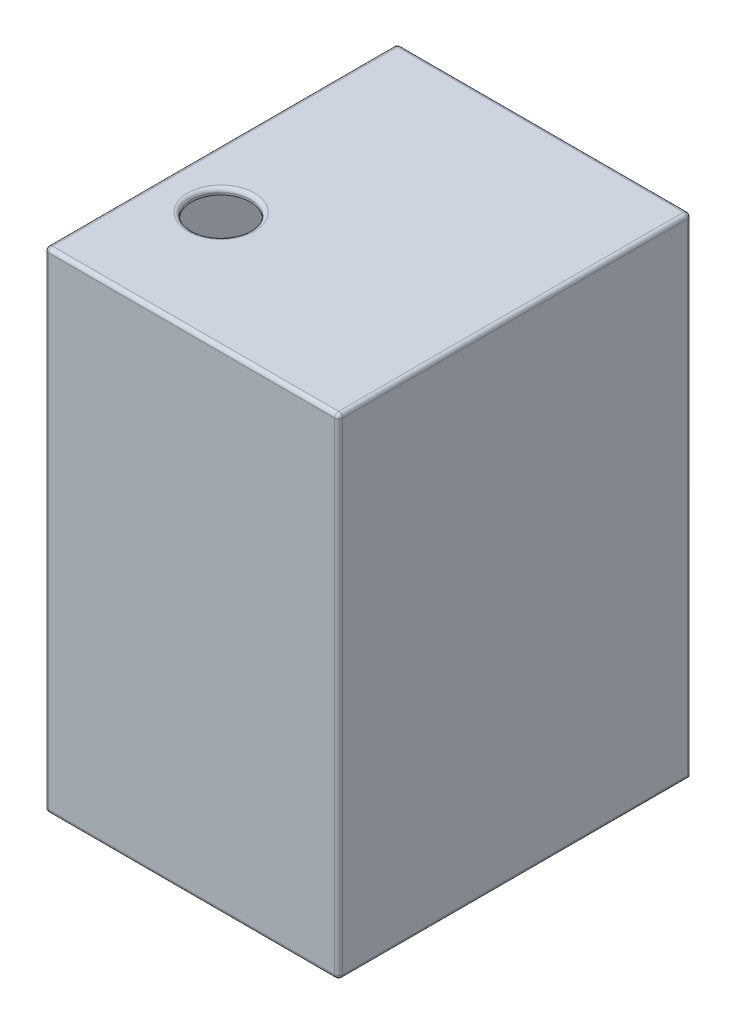
ISO-10303-21;
HEADER;
FILE_DESCRIPTION(('STEP AP214'),'2;1');
FILE_NAME('part.step','',(''),(''),'','','');
FILE_SCHEMA(('AUTOMOTIVE_DESIGN { 1 0 10303 214 1 1 1 1 }'));
ENDSEC;
DATA;
#1=APPLICATION_CONTEXT('core data for automotive mechanical design processes');
#2=APPLICATION_PROTOCOL_DEFINITION('international standard','automotive_design',2000,#1);
#3=PRODUCT_CONTEXT('',#1,'mechanical');
#4=PRODUCT('Part','Part','',(#3));
#5=PRODUCT_RELATED_PRODUCT_CATEGORY('part','',(#4));
#6=PRODUCT_DEFINITION_FORMATION('','',#4);
#7=PRODUCT_DEFINITION_CONTEXT('part definition',#1,'design');
#8=PRODUCT_DEFINITION('design','',#6,#7);
#9=PRODUCT_DEFINITION_SHAPE('','',#8);
#10=(LENGTH_UNIT() NAMED_UNIT(*) SI_UNIT(.MILLI.,.METRE.));
#11=(NAMED_UNIT(*) PLANE_ANGLE_UNIT() SI_UNIT($,.RADIAN.));
#12=(NAMED_UNIT(*) SI_UNIT($,.STERADIAN.) SOLID_ANGLE_UNIT());
#13=UNCERTAINTY_MEASURE_WITH_UNIT(LENGTH_MEASURE(1.E-05),#10,'distance_accuracy_value','');
#14=(GEOMETRIC_REPRESENTATION_CONTEXT(3) GLOBAL_UNCERTAINTY_ASSIGNED_CONTEXT((#13)) GLOBAL_UNIT_ASSIGNED_CONTEXT((#10,
#11,#12)) REPRESENTATION_CONTEXT('',''));
#15=CARTESIAN_POINT('',(0.,0.,0.));
#16=DIRECTION('',(0.,0.,1.));
#17=DIRECTION('',(1.,0.,0.));
#18=AXIS2_PLACEMENT_3D('',#15,#16,#17);
#19=CARTESIAN_POINT('',(0.,0.,0.));
#20=DIRECTION('',(0.,0.,1.));
#21=DIRECTION('',(1.,0.,0.));
#22=AXIS2_PLACEMENT_3D('',#19,#20,#21);
#23=PLANE('',#22);
#24=DIRECTION('',(1.,0.,0.));
#25=VECTOR('',#24,1.);
#26=CARTESIAN_POINT('',(0.,-250.,0.));
#27=LINE('',#26,#25);
#28=CARTESIAN_POINT('',(70.,-250.,0.));
#29=VERTEX_POINT('',#28);
#30=CARTESIAN_POINT('',(148.,-250.,0.));
#31=VERTEX_POINT('',#30);
#32=EDGE_CURVE('E167',#29,#31,#27,.T.);
#33=ORIENTED_EDGE('',*,*,#32,.F.);
#34=CARTESIAN_POINT('',(70.,-235.,0.));
#35=DIRECTION('',(0.,0.,-1.));
#36=DIRECTION('',(-1.,0.,0.));
#37=AXIS2_PLACEMENT_3D('',#34,#35,#36);
#38=CIRCLE('',#37,15.);
#39=EDGE_CURVE('E177',#29,#29,#38,.T.);
#40=ORIENTED_EDGE('',*,*,#39,.F.);
#41=CARTESIAN_POINT('',(2.00000000000003,-250.,0.));
#42=VERTEX_POINT('',#41);
#43=EDGE_CURVE('E163',#42,#29,#27,.T.);
#44=ORIENTED_EDGE('',*,*,#43,.F.);
#45=DIRECTION('',(0.,-1.,0.));
#46=VECTOR('',#45,1.);
#47=CARTESIAN_POINT('',(2.,0.,0.));
#48=LINE('',#47,#46);
#49=CARTESIAN_POINT('',(2.,-2.,0.));
#50=VERTEX_POINT('',#49);
#51=EDGE_CURVE('E222',#42,#50,#48,.F.);
#52=ORIENTED_EDGE('',*,*,#51,.T.);
#53=DIRECTION('',(-1.,0.,0.));
#54=VECTOR('',#53,1.);
#55=CARTESIAN_POINT('',(0.,-2.,0.));
#56=LINE('',#55,#54);
#57=CARTESIAN_POINT('',(148.,-2.,0.));
#58=VERTEX_POINT('',#57);
#59=EDGE_CURVE('E220',#50,#58,#56,.F.);
#60=ORIENTED_EDGE('',*,*,#59,.T.);
#61=DIRECTION('',(0.,1.,0.));
#62=VECTOR('',#61,1.);
#63=CARTESIAN_POINT('',(148.,0.,0.));
#64=LINE('',#63,#62);
#65=EDGE_CURVE('E179',#58,#31,#64,.F.);
#66=ORIENTED_EDGE('',*,*,#65,.T.);
#67=EDGE_LOOP('',(#33,#40,#44,#52,#60,#66));
#68=FACE_BOUND('',#67,.T.);
#69=ADVANCED_FACE('F40',(#68),#23,.F.);
#70=CARTESIAN_POINT('',(0.,-247.,180.));
#71=DIRECTION('',(0.,1.,0.));
#72=DIRECTION('',(0.,0.,1.));
#73=AXIS2_PLACEMENT_3D('',#70,#71,#72);
#74=PLANE('',#73);
#75=DIRECTION('',(0.,0.,-1.));
#76=VECTOR('',#75,1.);
#77=CARTESIAN_POINT('',(75.,-247.,15.));
#78=LINE('',#77,#76);
#79=CARTESIAN_POINT('',(75.,-247.,15.));
#80=VERTEX_POINT('',#79);
#81=CARTESIAN_POINT('',(75.,-247.,3.));
#82=VERTEX_POINT('',#81);
#83=EDGE_CURVE('E55',#80,#82,#78,.T.);
#84=ORIENTED_EDGE('',*,*,#83,.F.);
#85=DIRECTION('',(-1.,0.,0.));
#86=VECTOR('',#85,1.);
#87=CARTESIAN_POINT('',(0.,-247.,15.));
#88=LINE('',#87,#86);
#89=CARTESIAN_POINT('',(65.,-247.,15.));
#90=VERTEX_POINT('',#89);
#91=EDGE_CURVE('E11',#80,#90,#88,.T.);
#92=ORIENTED_EDGE('',*,*,#91,.T.);
#93=DIRECTION('',(0.,0.,-1.));
#94=VECTOR('',#93,1.);
#95=CARTESIAN_POINT('',(65.,-247.,15.));
#96=LINE('',#95,#94);
#97=CARTESIAN_POINT('',(65.,-247.,3.));
#98=VERTEX_POINT('',#97);
#99=EDGE_CURVE('E704',#98,#90,#96,.F.);
#100=ORIENTED_EDGE('',*,*,#99,.F.);
#101=DIRECTION('',(1.,0.,0.));
#102=VECTOR('',#101,1.);
#103=CARTESIAN_POINT('',(0.,-247.,3.));
#104=LINE('',#103,#102);
#105=CARTESIAN_POINT('',(3.00000000000003,-247.,3.));
#106=VERTEX_POINT('',#105);
#107=EDGE_CURVE('E702',#106,#98,#104,.T.);
#108=ORIENTED_EDGE('',*,*,#107,.F.);
#109=DIRECTION('',(0.,0.,-1.));
#110=VECTOR('',#109,1.);
#111=CARTESIAN_POINT('',(3.00000000000003,-247.,180.));
#112=LINE('',#111,#110);
#113=CARTESIAN_POINT('',(3.00000000000003,-247.,177.));
#114=VERTEX_POINT('',#113);
#115=EDGE_CURVE('E181',#114,#106,#112,.T.);
#116=ORIENTED_EDGE('',*,*,#115,.F.);
#117=DIRECTION('',(1.,0.,0.));
#118=VECTOR('',#117,1.);
#119=CARTESIAN_POINT('',(0.,-247.,177.));
#120=LINE('',#119,#118);
#121=CARTESIAN_POINT('',(147.,-247.,177.));
#122=VERTEX_POINT('',#121);
#123=EDGE_CURVE('E718',#114,#122,#120,.T.);
#124=ORIENTED_EDGE('',*,*,#123,.T.);
#125=DIRECTION('',(0.,0.,-1.));
#126=VECTOR('',#125,1.);
#127=CARTESIAN_POINT('',(147.,-247.,180.));
#128=LINE('',#127,#126);
#129=CARTESIAN_POINT('',(147.,-247.,3.));
#130=VERTEX_POINT('',#129);
#131=EDGE_CURVE('E183',#122,#130,#128,.T.);
#132=ORIENTED_EDGE('',*,*,#131,.T.);
#133=EDGE_CURVE('E699',#82,#130,#104,.T.);
#134=ORIENTED_EDGE('',*,*,#133,.F.);
#135=EDGE_LOOP('',(#84,#92,#100,#108,#116,#124,#132,#134));
#136=FACE_BOUND('',#135,.T.);
#137=ADVANCED_FACE('F380',(#136),#74,.T.);
#138=CARTESIAN_POINT('',(0.,0.,3.));
#139=DIRECTION('',(0.,0.,1.));
#140=DIRECTION('',(1.,0.,0.));
#141=AXIS2_PLACEMENT_3D('',#138,#139,#140);
#142=PLANE('',#141);
#143=CARTESIAN_POINT('',(70.,-235.,3.));
#144=DIRECTION('',(0.,0.,1.));
#145=DIRECTION('',(1.,0.,0.));
#146=AXIS2_PLACEMENT_3D('',#143,#144,#145);
#147=CIRCLE('',#146,13.);
#148=EDGE_CURVE('E696',#82,#98,#147,.T.);
#149=ORIENTED_EDGE('',*,*,#148,.F.);
#150=ORIENTED_EDGE('',*,*,#133,.T.);
#151=DIRECTION('',(0.,1.,0.));
#152=VECTOR('',#151,1.);
#153=CARTESIAN_POINT('',(147.,0.,3.));
#154=LINE('',#153,#152);
#155=CARTESIAN_POINT('',(147.,-2.99999999999998,3.));
#156=VERTEX_POINT('',#155);
#157=EDGE_CURVE('E711',#130,#156,#154,.T.);
#158=ORIENTED_EDGE('',*,*,#157,.T.);
#159=DIRECTION('',(-1.,0.,0.));
#160=VECTOR('',#159,1.);
#161=CARTESIAN_POINT('',(0.,-3.,3.));
#162=LINE('',#161,#160);
#163=CARTESIAN_POINT('',(3.,-2.99999999999999,3.));
#164=VERTEX_POINT('',#163);
#165=EDGE_CURVE('E174',#156,#164,#162,.T.);
#166=ORIENTED_EDGE('',*,*,#165,.T.);
#167=DIRECTION('',(0.,-1.,0.));
#168=VECTOR('',#167,1.);
#169=CARTESIAN_POINT('',(3.,0.,3.));
#170=LINE('',#169,#168);
#171=EDGE_CURVE('E709',#164,#106,#170,.T.);
#172=ORIENTED_EDGE('',*,*,#171,.T.);
#173=ORIENTED_EDGE('',*,*,#107,.T.);
#174=EDGE_LOOP('',(#149,#150,#158,#166,#172,#173));
#175=FACE_BOUND('',#174,.T.);
#176=ADVANCED_FACE('F385',(#175),#142,.T.);
#177=CARTESIAN_POINT('',(0.,0.,177.));
#178=DIRECTION('',(0.,0.,1.));
#179=DIRECTION('',(1.,0.,0.));
#180=AXIS2_PLACEMENT_3D('',#177,#178,#179);
#181=PLANE('',#180);
#182=DIRECTION('',(-1.,0.,0.));
#183=VECTOR('',#182,1.);
#184=CARTESIAN_POINT('',(0.,-3.,177.));
#185=LINE('',#184,#183);
#186=CARTESIAN_POINT('',(147.,-2.99999999999998,177.));
#187=VERTEX_POINT('',#186);
#188=CARTESIAN_POINT('',(3.,-3.,177.));
#189=VERTEX_POINT('',#188);
#190=EDGE_CURVE('E712',#187,#189,#185,.T.);
#191=ORIENTED_EDGE('',*,*,#190,.F.);
#192=DIRECTION('',(0.,1.,0.));
#193=VECTOR('',#192,1.);
#194=CARTESIAN_POINT('',(147.,0.,177.));
#195=LINE('',#194,#193);
#196=EDGE_CURVE('E187',#122,#187,#195,.T.);
#197=ORIENTED_EDGE('',*,*,#196,.F.);
#198=ORIENTED_EDGE('',*,*,#123,.F.);
#199=DIRECTION('',(0.,-1.,0.));
#200=VECTOR('',#199,1.);
#201=CARTESIAN_POINT('',(3.,0.,177.));
#202=LINE('',#201,#200);
#203=EDGE_CURVE('E716',#189,#114,#202,.T.);
#204=ORIENTED_EDGE('',*,*,#203,.F.);
#205=EDGE_LOOP('',(#191,#197,#198,#204));
#206=FACE_BOUND('',#205,.T.);
#207=ADVANCED_FACE('F647',(#206),#181,.F.);
#208=CARTESIAN_POINT('',(147.,0.,180.));
#209=DIRECTION('',(-1.,0.,0.));
#210=DIRECTION('',(0.,-1.,0.));
#211=AXIS2_PLACEMENT_3D('',#208,#209,#210);
#212=PLANE('',#211);
#213=ORIENTED_EDGE('',*,*,#196,.T.);
#214=DIRECTION('',(0.,0.,-1.));
#215=VECTOR('',#214,1.);
#216=CARTESIAN_POINT('',(147.,-2.99999999999998,180.));
#217=LINE('',#216,#215);
#218=EDGE_CURVE('E195',#187,#156,#217,.T.);
#219=ORIENTED_EDGE('',*,*,#218,.T.);
#220=ORIENTED_EDGE('',*,*,#157,.F.);
#221=ORIENTED_EDGE('',*,*,#131,.F.);
#222=EDGE_LOOP('',(#213,#219,#220,#221));
#223=FACE_BOUND('',#222,.T.);
#224=ADVANCED_FACE('F637',(#223),#212,.T.);
#225=CARTESIAN_POINT('',(3.,0.,180.));
#226=DIRECTION('',(1.,0.,0.));
#227=DIRECTION('',(0.,1.,0.));
#228=AXIS2_PLACEMENT_3D('',#225,#226,#227);
#229=PLANE('',#228);
#230=ORIENTED_EDGE('',*,*,#171,.F.);
#231=DIRECTION('',(0.,0.,1.));
#232=VECTOR('',#231,1.);
#233=CARTESIAN_POINT('',(3.,-3.,180.));
#234=LINE('',#233,#232);
#235=EDGE_CURVE('E724',#164,#189,#234,.T.);
#236=ORIENTED_EDGE('',*,*,#235,.T.);
#237=ORIENTED_EDGE('',*,*,#203,.T.);
#238=ORIENTED_EDGE('',*,*,#115,.T.);
#239=EDGE_LOOP('',(#230,#236,#237,#238));
#240=FACE_BOUND('',#239,.T.);
#241=ADVANCED_FACE('F620',(#240),#229,.T.);
#242=CARTESIAN_POINT('',(150.,-2.99999999999998,180.));
#243=DIRECTION('',(0.,1.,0.));
#244=DIRECTION('',(-1.,0.,0.));
#245=AXIS2_PLACEMENT_3D('',#242,#243,#244);
#246=PLANE('',#245);
#247=CARTESIAN_POINT('',(30.,-3.,120.));
#248=DIRECTION('',(0.,1.,0.));
#249=DIRECTION('',(-1.,0.,0.));
#250=AXIS2_PLACEMENT_3D('',#247,#248,#249);
#251=CIRCLE('',#250,15.);
#252=CARTESIAN_POINT('',(15.,-3.,120.));
#253=VERTEX_POINT('',#252);
#254=EDGE_CURVE('E192',#253,#253,#251,.T.);
#255=ORIENTED_EDGE('',*,*,#254,.T.);
#256=EDGE_LOOP('',(#255));
#257=FACE_BOUND('',#256,.T.);
#258=ORIENTED_EDGE('',*,*,#218,.F.);
#259=ORIENTED_EDGE('',*,*,#190,.T.);
#260=ORIENTED_EDGE('',*,*,#235,.F.);
#261=ORIENTED_EDGE('',*,*,#165,.F.);
#262=EDGE_LOOP('',(#258,#259,#260,#261));
#263=FACE_BOUND('',#262,.T.);
#264=ADVANCED_FACE('F610',(#257,#263),#246,.F.);
#265=CARTESIAN_POINT('',(30.,-10.,120.));
#266=DIRECTION('',(0.,1.,0.));
#267=DIRECTION('',(0.,0.,1.));
#268=AXIS2_PLACEMENT_3D('',#265,#266,#267);
#269=CYLINDRICAL_SURFACE('',#268,15.);
#270=CARTESIAN_POINT('',(30.,-2.,120.));
#271=DIRECTION('',(0.,-1.,0.));
#272=DIRECTION('',(0.,0.,-1.));
#273=AXIS2_PLACEMENT_3D('',#270,#271,#272);
#274=CIRCLE('',#273,15.);
#275=CARTESIAN_POINT('',(30.,-2.,105.));
#276=VERTEX_POINT('',#275);
#277=EDGE_CURVE('E236',#276,#276,#274,.F.);
#278=ORIENTED_EDGE('',*,*,#277,.T.);
#279=EDGE_LOOP('',(#278));
#280=FACE_BOUND('',#279,.T.);
#281=ORIENTED_EDGE('',*,*,#254,.F.);
#282=EDGE_LOOP('',(#281));
#283=FACE_BOUND('',#282,.T.);
#284=ADVANCED_FACE('F393',(#280,#283),#269,.F.);
#285=CARTESIAN_POINT('',(0.,0.,180.));
#286=DIRECTION('',(0.,-1.,0.));
#287=DIRECTION('',(0.,0.,-1.));
#288=AXIS2_PLACEMENT_3D('',#285,#286,#287);
#289=PLANE('',#288);
#290=CARTESIAN_POINT('',(30.,0.,120.));
#291=DIRECTION('',(0.,-1.,0.));
#292=DIRECTION('',(0.,0.,-1.));
#293=AXIS2_PLACEMENT_3D('',#290,#291,#292);
#294=CIRCLE('',#293,17.);
#295=CARTESIAN_POINT('',(30.,0.,103.));
#296=VERTEX_POINT('',#295);
#297=EDGE_CURVE('E233',#296,#296,#294,.T.);
#298=ORIENTED_EDGE('',*,*,#297,.T.);
#299=EDGE_LOOP('',(#298));
#300=FACE_BOUND('',#299,.T.);
#301=DIRECTION('',(0.,0.,-1.));
#302=VECTOR('',#301,1.);
#303=CARTESIAN_POINT('',(2.,0.,180.));
#304=LINE('',#303,#302);
#305=CARTESIAN_POINT('',(2.,0.,2.));
#306=VERTEX_POINT('',#305);
#307=CARTESIAN_POINT('',(2.,0.,178.));
#308=VERTEX_POINT('',#307);
#309=EDGE_CURVE('E228',#306,#308,#304,.F.);
#310=ORIENTED_EDGE('',*,*,#309,.T.);
#311=DIRECTION('',(-1.,0.,0.));
#312=VECTOR('',#311,1.);
#313=CARTESIAN_POINT('',(150.,0.,178.));
#314=LINE('',#313,#312);
#315=CARTESIAN_POINT('',(148.,0.,178.));
#316=VERTEX_POINT('',#315);
#317=EDGE_CURVE('E230',#308,#316,#314,.F.);
#318=ORIENTED_EDGE('',*,*,#317,.T.);
#319=DIRECTION('',(0.,0.,-1.));
#320=VECTOR('',#319,1.);
#321=CARTESIAN_POINT('',(148.,0.,180.));
#322=LINE('',#321,#320);
#323=CARTESIAN_POINT('',(148.,0.,2.));
#324=VERTEX_POINT('',#323);
#325=EDGE_CURVE('E224',#316,#324,#322,.T.);
#326=ORIENTED_EDGE('',*,*,#325,.T.);
#327=DIRECTION('',(-1.,0.,0.));
#328=VECTOR('',#327,1.);
#329=CARTESIAN_POINT('',(0.,0.,2.));
#330=LINE('',#329,#328);
#331=EDGE_CURVE('E226',#324,#306,#330,.T.);
#332=ORIENTED_EDGE('',*,*,#331,.T.);
#333=EDGE_LOOP('',(#310,#318,#326,#332));
#334=FACE_BOUND('',#333,.T.);
#335=ADVANCED_FACE('F320',(#300,#334),#289,.F.);
#336=CARTESIAN_POINT('',(0.,0.,180.));
#337=DIRECTION('',(1.,0.,0.));
#338=DIRECTION('',(0.,1.,0.));
#339=AXIS2_PLACEMENT_3D('',#336,#337,#338);
#340=PLANE('',#339);
#341=DIRECTION('',(0.,0.,-1.));
#342=VECTOR('',#341,1.);
#343=CARTESIAN_POINT('',(0.,-248.,180.));
#344=LINE('',#343,#342);
#345=CARTESIAN_POINT('',(0.,-248.,2.));
#346=VERTEX_POINT('',#345);
#347=CARTESIAN_POINT('',(0.,-248.,178.));
#348=VERTEX_POINT('',#347);
#349=EDGE_CURVE('E214',#346,#348,#344,.F.);
#350=ORIENTED_EDGE('',*,*,#349,.T.);
#351=DIRECTION('',(0.,-1.,0.));
#352=VECTOR('',#351,1.);
#353=CARTESIAN_POINT('',(0.,0.,178.));
#354=LINE('',#353,#352);
#355=CARTESIAN_POINT('',(0.,-2.,178.));
#356=VERTEX_POINT('',#355);
#357=EDGE_CURVE('E216',#348,#356,#354,.F.);
#358=ORIENTED_EDGE('',*,*,#357,.T.);
#359=DIRECTION('',(0.,0.,-1.));
#360=VECTOR('',#359,1.);
#361=CARTESIAN_POINT('',(0.,-2.,180.));
#362=LINE('',#361,#360);
#363=CARTESIAN_POINT('',(0.,-2.,2.));
#364=VERTEX_POINT('',#363);
#365=EDGE_CURVE('E210',#356,#364,#362,.T.);
#366=ORIENTED_EDGE('',*,*,#365,.T.);
#367=DIRECTION('',(0.,-1.,0.));
#368=VECTOR('',#367,1.);
#369=CARTESIAN_POINT('',(0.,0.,2.));
#370=LINE('',#369,#368);
#371=EDGE_CURVE('E212',#364,#346,#370,.T.);
#372=ORIENTED_EDGE('',*,*,#371,.T.);
#373=EDGE_LOOP('',(#350,#358,#366,#372));
#374=FACE_BOUND('',#373,.T.);
#375=ADVANCED_FACE('F312',(#374),#340,.F.);
#376=CARTESIAN_POINT('',(0.,-250.,180.));
#377=DIRECTION('',(0.,1.,0.));
#378=DIRECTION('',(0.,0.,1.));
#379=AXIS2_PLACEMENT_3D('',#376,#377,#378);
#380=PLANE('',#379);
#381=DIRECTION('',(1.,0.,0.));
#382=VECTOR('',#381,1.);
#383=CARTESIAN_POINT('',(0.,-250.,178.));
#384=LINE('',#383,#382);
#385=CARTESIAN_POINT('',(148.,-250.,178.));
#386=VERTEX_POINT('',#385);
#387=CARTESIAN_POINT('',(2.00000000000003,-250.,178.));
#388=VERTEX_POINT('',#387);
#389=EDGE_CURVE('E207',#386,#388,#384,.F.);
#390=ORIENTED_EDGE('',*,*,#389,.T.);
#391=DIRECTION('',(0.,0.,-1.));
#392=VECTOR('',#391,1.);
#393=CARTESIAN_POINT('',(2.00000000000003,-250.,180.));
#394=LINE('',#393,#392);
#395=EDGE_CURVE('E170',#388,#42,#394,.T.);
#396=ORIENTED_EDGE('',*,*,#395,.T.);
#397=ORIENTED_EDGE('',*,*,#43,.T.);
#398=ORIENTED_EDGE('',*,*,#32,.T.);
#399=DIRECTION('',(0.,0.,-1.));
#400=VECTOR('',#399,1.);
#401=CARTESIAN_POINT('',(148.,-250.,180.));
#402=LINE('',#401,#400);
#403=EDGE_CURVE('E205',#31,#386,#402,.F.);
#404=ORIENTED_EDGE('',*,*,#403,.T.);
#405=EDGE_LOOP('',(#390,#396,#397,#398,#404));
#406=FACE_BOUND('',#405,.T.);
#407=ADVANCED_FACE('F166',(#406),#380,.F.);
#408=CARTESIAN_POINT('',(150.,0.,180.));
#409=DIRECTION('',(-1.,0.,0.));
#410=DIRECTION('',(0.,-1.,0.));
#411=AXIS2_PLACEMENT_3D('',#408,#409,#410);
#412=PLANE('',#411);
#413=DIRECTION('',(0.,0.,-1.));
#414=VECTOR('',#413,1.);
#415=CARTESIAN_POINT('',(150.,-248.,180.));
#416=LINE('',#415,#414);
#417=CARTESIAN_POINT('',(150.,-248.,178.));
#418=VERTEX_POINT('',#417);
#419=CARTESIAN_POINT('',(150.,-248.,2.));
#420=VERTEX_POINT('',#419);
#421=EDGE_CURVE('E63',#418,#420,#416,.T.);
#422=ORIENTED_EDGE('',*,*,#421,.T.);
#423=DIRECTION('',(0.,1.,0.));
#424=VECTOR('',#423,1.);
#425=CARTESIAN_POINT('',(150.,0.,2.));
#426=LINE('',#425,#424);
#427=CARTESIAN_POINT('',(150.,-2.,2.));
#428=VERTEX_POINT('',#427);
#429=EDGE_CURVE('E48',#420,#428,#426,.T.);
#430=ORIENTED_EDGE('',*,*,#429,.T.);
#431=DIRECTION('',(0.,0.,-1.));
#432=VECTOR('',#431,1.);
#433=CARTESIAN_POINT('',(150.,-2.,180.));
#434=LINE('',#433,#432);
#435=CARTESIAN_POINT('',(150.,-2.,178.));
#436=VERTEX_POINT('',#435);
#437=EDGE_CURVE('E239',#428,#436,#434,.F.);
#438=ORIENTED_EDGE('',*,*,#437,.T.);
#439=DIRECTION('',(0.,1.,0.));
#440=VECTOR('',#439,1.);
#441=CARTESIAN_POINT('',(150.,-250.,178.));
#442=LINE('',#441,#440);
#443=EDGE_CURVE('E241',#436,#418,#442,.F.);
#444=ORIENTED_EDGE('',*,*,#443,.T.);
#445=EDGE_LOOP('',(#422,#430,#438,#444));
#446=FACE_BOUND('',#445,.T.);
#447=ADVANCED_FACE('F395',(#446),#412,.F.);
#448=CARTESIAN_POINT('',(0.,0.,180.));
#449=DIRECTION('',(0.,0.,1.));
#450=DIRECTION('',(1.,0.,0.));
#451=AXIS2_PLACEMENT_3D('',#448,#449,#450);
#452=PLANE('',#451);
#453=DIRECTION('',(0.,-1.,0.));
#454=VECTOR('',#453,1.);
#455=CARTESIAN_POINT('',(2.00000000000003,-250.,180.));
#456=LINE('',#455,#454);
#457=CARTESIAN_POINT('',(2.,-2.,180.));
#458=VERTEX_POINT('',#457);
#459=CARTESIAN_POINT('',(2.00000000000003,-248.,180.));
#460=VERTEX_POINT('',#459);
#461=EDGE_CURVE('E200',#458,#460,#456,.T.);
#462=ORIENTED_EDGE('',*,*,#461,.T.);
#463=DIRECTION('',(1.,0.,0.));
#464=VECTOR('',#463,1.);
#465=CARTESIAN_POINT('',(150.,-248.,180.));
#466=LINE('',#465,#464);
#467=CARTESIAN_POINT('',(148.,-248.,180.));
#468=VERTEX_POINT('',#467);
#469=EDGE_CURVE('E202',#460,#468,#466,.T.);
#470=ORIENTED_EDGE('',*,*,#469,.T.);
#471=DIRECTION('',(0.,1.,0.));
#472=VECTOR('',#471,1.);
#473=CARTESIAN_POINT('',(148.,0.,180.));
#474=LINE('',#473,#472);
#475=CARTESIAN_POINT('',(148.,-2.,180.));
#476=VERTEX_POINT('',#475);
#477=EDGE_CURVE('E191',#468,#476,#474,.T.);
#478=ORIENTED_EDGE('',*,*,#477,.T.);
#479=DIRECTION('',(-1.,0.,0.));
#480=VECTOR('',#479,1.);
#481=CARTESIAN_POINT('',(0.,-2.,180.));
#482=LINE('',#481,#480);
#483=EDGE_CURVE('E198',#476,#458,#482,.T.);
#484=ORIENTED_EDGE('',*,*,#483,.T.);
#485=EDGE_LOOP('',(#462,#470,#478,#484));
#486=FACE_BOUND('',#485,.T.);
#487=ADVANCED_FACE('F360',(#486),#452,.T.);
#488=CARTESIAN_POINT('',(0.,-2.,2.));
#489=DIRECTION('',(-1.,0.,0.));
#490=DIRECTION('',(0.,0.,1.));
#491=AXIS2_PLACEMENT_3D('',#488,#489,#490);
#492=CYLINDRICAL_SURFACE('',#491,2.);
#493=CARTESIAN_POINT('',(2.,-2.,2.));
#494=DIRECTION('',(-1.,0.,0.));
#495=DIRECTION('',(0.,0.,1.));
#496=AXIS2_PLACEMENT_3D('',#493,#494,#495);
#497=CIRCLE('',#496,2.);
#498=EDGE_CURVE('E196',#306,#50,#497,.T.);
#499=ORIENTED_EDGE('',*,*,#498,.F.);
#500=ORIENTED_EDGE('',*,*,#331,.F.);
#501=CARTESIAN_POINT('',(148.,-2.,2.));
#502=DIRECTION('',(1.,0.,0.));
#503=DIRECTION('',(0.,1.,0.));
#504=AXIS2_PLACEMENT_3D('',#501,#502,#503);
#505=CIRCLE('',#504,2.);
#506=EDGE_CURVE('E288',#58,#324,#505,.T.);
#507=ORIENTED_EDGE('',*,*,#506,.F.);
#508=ORIENTED_EDGE('',*,*,#59,.F.);
#509=EDGE_LOOP('',(#499,#500,#507,#508));
#510=FACE_BOUND('',#509,.T.);
#511=ADVANCED_FACE('F336',(#510),#492,.T.);
#512=CARTESIAN_POINT('',(2.,-2.,2.));
#513=DIRECTION('',(0.,1.,0.));
#514=DIRECTION('',(0.,0.,1.));
#515=AXIS2_PLACEMENT_3D('',#512,#513,#514);
#516=SPHERICAL_SURFACE('',#515,2.);
#517=CARTESIAN_POINT('',(2.,-2.,2.));
#518=DIRECTION('',(0.,1.,0.));
#519=DIRECTION('',(0.,0.,1.));
#520=AXIS2_PLACEMENT_3D('',#517,#518,#519);
#521=CIRCLE('',#520,2.);
#522=EDGE_CURVE('E285',#364,#50,#521,.F.);
#523=ORIENTED_EDGE('',*,*,#522,.F.);
#524=CARTESIAN_POINT('',(2.,-2.,2.));
#525=DIRECTION('',(0.,0.,-1.));
#526=DIRECTION('',(-1.,0.,0.));
#527=AXIS2_PLACEMENT_3D('',#524,#525,#526);
#528=CIRCLE('',#527,2.);
#529=EDGE_CURVE('E294',#306,#364,#528,.F.);
#530=ORIENTED_EDGE('',*,*,#529,.F.);
#531=ORIENTED_EDGE('',*,*,#498,.T.);
#532=EDGE_LOOP('',(#523,#530,#531));
#533=FACE_BOUND('',#532,.T.);
#534=ADVANCED_FACE('F301',(#533),#516,.T.);
#535=CARTESIAN_POINT('',(2.,-2.,180.));
#536=DIRECTION('',(0.,0.,-1.));
#537=DIRECTION('',(-1.,0.,0.));
#538=AXIS2_PLACEMENT_3D('',#535,#536,#537);
#539=CYLINDRICAL_SURFACE('',#538,2.);
#540=ORIENTED_EDGE('',*,*,#529,.T.);
#541=ORIENTED_EDGE('',*,*,#365,.F.);
#542=CARTESIAN_POINT('',(2.,-2.,178.));
#543=DIRECTION('',(0.,0.,1.));
#544=DIRECTION('',(1.,0.,0.));
#545=AXIS2_PLACEMENT_3D('',#542,#543,#544);
#546=CIRCLE('',#545,2.);
#547=EDGE_CURVE('E282',#308,#356,#546,.T.);
#548=ORIENTED_EDGE('',*,*,#547,.F.);
#549=ORIENTED_EDGE('',*,*,#309,.F.);
#550=EDGE_LOOP('',(#540,#541,#548,#549));
#551=FACE_BOUND('',#550,.T.);
#552=ADVANCED_FACE('F317',(#551),#539,.T.);
#553=CARTESIAN_POINT('',(0.,-2.,178.));
#554=DIRECTION('',(1.,0.,0.));
#555=DIRECTION('',(0.,0.,-1.));
#556=AXIS2_PLACEMENT_3D('',#553,#554,#555);
#557=CYLINDRICAL_SURFACE('',#556,2.);
#558=CARTESIAN_POINT('',(148.,-2.,178.));
#559=DIRECTION('',(1.,0.,0.));
#560=DIRECTION('',(0.,0.,-1.));
#561=AXIS2_PLACEMENT_3D('',#558,#559,#560);
#562=CIRCLE('',#561,2.);
#563=EDGE_CURVE('E276',#316,#476,#562,.T.);
#564=ORIENTED_EDGE('',*,*,#563,.F.);
#565=ORIENTED_EDGE('',*,*,#317,.F.);
#566=CARTESIAN_POINT('',(2.,-2.,178.));
#567=DIRECTION('',(-1.,0.,0.));
#568=DIRECTION('',(0.,0.,1.));
#569=AXIS2_PLACEMENT_3D('',#566,#567,#568);
#570=CIRCLE('',#569,2.);
#571=EDGE_CURVE('E279',#458,#308,#570,.T.);
#572=ORIENTED_EDGE('',*,*,#571,.F.);
#573=ORIENTED_EDGE('',*,*,#483,.F.);
#574=EDGE_LOOP('',(#564,#565,#572,#573));
#575=FACE_BOUND('',#574,.T.);
#576=ADVANCED_FACE('F324',(#575),#557,.T.);
#577=CARTESIAN_POINT('',(148.,-2.,180.));
#578=DIRECTION('',(0.,0.,-1.));
#579=DIRECTION('',(-1.,0.,0.));
#580=AXIS2_PLACEMENT_3D('',#577,#578,#579);
#581=CYLINDRICAL_SURFACE('',#580,2.);
#582=CARTESIAN_POINT('',(148.,-2.,2.));
#583=DIRECTION('',(0.,0.,-1.));
#584=DIRECTION('',(-1.,0.,0.));
#585=AXIS2_PLACEMENT_3D('',#582,#583,#584);
#586=CIRCLE('',#585,2.);
#587=EDGE_CURVE('E291',#324,#428,#586,.T.);
#588=ORIENTED_EDGE('',*,*,#587,.F.);
#589=ORIENTED_EDGE('',*,*,#325,.F.);
#590=CARTESIAN_POINT('',(148.,-2.,178.));
#591=DIRECTION('',(0.,0.,1.));
#592=DIRECTION('',(1.,0.,0.));
#593=AXIS2_PLACEMENT_3D('',#590,#591,#592);
#594=CIRCLE('',#593,2.);
#595=EDGE_CURVE('E274',#436,#316,#594,.T.);
#596=ORIENTED_EDGE('',*,*,#595,.F.);
#597=ORIENTED_EDGE('',*,*,#437,.F.);
#598=EDGE_LOOP('',(#588,#589,#596,#597));
#599=FACE_BOUND('',#598,.T.);
#600=ADVANCED_FACE('F333',(#599),#581,.T.);
#601=CARTESIAN_POINT('',(148.,-2.,2.));
#602=DIRECTION('',(0.,1.,0.));
#603=DIRECTION('',(-1.,0.,0.));
#604=AXIS2_PLACEMENT_3D('',#601,#602,#603);
#605=SPHERICAL_SURFACE('',#604,2.);
#606=ORIENTED_EDGE('',*,*,#506,.T.);
#607=ORIENTED_EDGE('',*,*,#587,.T.);
#608=CARTESIAN_POINT('',(148.,-2.,2.));
#609=DIRECTION('',(0.,1.,0.));
#610=DIRECTION('',(-1.,0.,0.));
#611=AXIS2_PLACEMENT_3D('',#608,#609,#610);
#612=CIRCLE('',#611,2.);
#613=EDGE_CURVE('E272',#58,#428,#612,.F.);
#614=ORIENTED_EDGE('',*,*,#613,.F.);
#615=EDGE_LOOP('',(#606,#607,#614));
#616=FACE_BOUND('',#615,.T.);
#617=ADVANCED_FACE('F339',(#616),#605,.T.);
#618=CARTESIAN_POINT('',(2.,0.,2.));
#619=DIRECTION('',(0.,-1.,0.));
#620=DIRECTION('',(1.,0.,0.));
#621=AXIS2_PLACEMENT_3D('',#618,#619,#620);
#622=CYLINDRICAL_SURFACE('',#621,2.);
#623=ORIENTED_EDGE('',*,*,#522,.T.);
#624=ORIENTED_EDGE('',*,*,#51,.F.);
#625=CARTESIAN_POINT('',(2.00000000000003,-248.,2.));
#626=DIRECTION('',(0.,-0.707106781186547,0.707106781186547));
#627=DIRECTION('',(0.,-0.707106781186547,-0.707106781186547));
#628=AXIS2_PLACEMENT_3D('',#625,#626,#627);
#629=ELLIPSE('',#628,2.82842712474619,2.);
#630=EDGE_CURVE('E269',#346,#42,#629,.T.);
#631=ORIENTED_EDGE('',*,*,#630,.F.);
#632=ORIENTED_EDGE('',*,*,#371,.F.);
#633=EDGE_LOOP('',(#623,#624,#631,#632));
#634=FACE_BOUND('',#633,.T.);
#635=ADVANCED_FACE('F308',(#634),#622,.T.);
#636=CARTESIAN_POINT('',(2.,-2.,178.));
#637=DIRECTION('',(0.,1.,0.));
#638=DIRECTION('',(0.,0.,1.));
#639=AXIS2_PLACEMENT_3D('',#636,#637,#638);
#640=SPHERICAL_SURFACE('',#639,2.);
#641=ORIENTED_EDGE('',*,*,#571,.T.);
#642=ORIENTED_EDGE('',*,*,#547,.T.);
#643=CARTESIAN_POINT('',(2.,-2.,178.));
#644=DIRECTION('',(0.,1.,0.));
#645=DIRECTION('',(-1.,0.,0.));
#646=AXIS2_PLACEMENT_3D('',#643,#644,#645);
#647=CIRCLE('',#646,2.);
#648=EDGE_CURVE('E267',#458,#356,#647,.F.);
#649=ORIENTED_EDGE('',*,*,#648,.F.);
#650=EDGE_LOOP('',(#641,#642,#649));
#651=FACE_BOUND('',#650,.T.);
#652=ADVANCED_FACE('F544',(#651),#640,.T.);
#653=CARTESIAN_POINT('',(148.,-2.,178.));
#654=DIRECTION('',(0.,1.,0.));
#655=DIRECTION('',(-1.,0.,0.));
#656=AXIS2_PLACEMENT_3D('',#653,#654,#655);
#657=SPHERICAL_SURFACE('',#656,2.);
#658=ORIENTED_EDGE('',*,*,#595,.T.);
#659=ORIENTED_EDGE('',*,*,#563,.T.);
#660=CARTESIAN_POINT('',(148.,-2.,178.));
#661=DIRECTION('',(0.,1.,0.));
#662=DIRECTION('',(-1.,0.,0.));
#663=AXIS2_PLACEMENT_3D('',#660,#661,#662);
#664=CIRCLE('',#663,2.);
#665=EDGE_CURVE('E264',#436,#476,#664,.F.);
#666=ORIENTED_EDGE('',*,*,#665,.F.);
#667=EDGE_LOOP('',(#658,#659,#666));
#668=FACE_BOUND('',#667,.T.);
#669=ADVANCED_FACE('F377',(#668),#657,.T.);
#670=CARTESIAN_POINT('',(148.,0.,2.));
#671=DIRECTION('',(0.,1.,0.));
#672=DIRECTION('',(-1.,0.,0.));
#673=AXIS2_PLACEMENT_3D('',#670,#671,#672);
#674=CYLINDRICAL_SURFACE('',#673,2.);
#675=ORIENTED_EDGE('',*,*,#613,.T.);
#676=ORIENTED_EDGE('',*,*,#429,.F.);
#677=CARTESIAN_POINT('',(148.,-248.,2.));
#678=DIRECTION('',(0.,0.707106781186547,-0.707106781186547));
#679=DIRECTION('',(0.,-0.707106781186547,-0.707106781186547));
#680=AXIS2_PLACEMENT_3D('',#677,#678,#679);
#681=ELLIPSE('',#680,2.82842712474619,2.);
#682=EDGE_CURVE('E261',#31,#420,#681,.F.);
#683=ORIENTED_EDGE('',*,*,#682,.F.);
#684=ORIENTED_EDGE('',*,*,#65,.F.);
#685=EDGE_LOOP('',(#675,#676,#683,#684));
#686=FACE_BOUND('',#685,.T.);
#687=ADVANCED_FACE('F341',(#686),#674,.T.);
#688=CARTESIAN_POINT('',(2.00000000000003,-248.,180.));
#689=DIRECTION('',(0.,0.,-1.));
#690=DIRECTION('',(-1.,0.,0.));
#691=AXIS2_PLACEMENT_3D('',#688,#689,#690);
#692=CYLINDRICAL_SURFACE('',#691,2.);
#693=ORIENTED_EDGE('',*,*,#630,.T.);
#694=ORIENTED_EDGE('',*,*,#395,.F.);
#695=CARTESIAN_POINT('',(2.00000000000003,-248.,178.));
#696=DIRECTION('',(0.,0.,1.));
#697=DIRECTION('',(1.,0.,0.));
#698=AXIS2_PLACEMENT_3D('',#695,#696,#697);
#699=CIRCLE('',#698,2.);
#700=EDGE_CURVE('E258',#348,#388,#699,.T.);
#701=ORIENTED_EDGE('',*,*,#700,.F.);
#702=ORIENTED_EDGE('',*,*,#349,.F.);
#703=EDGE_LOOP('',(#693,#694,#701,#702));
#704=FACE_BOUND('',#703,.T.);
#705=ADVANCED_FACE('F369',(#704),#692,.T.);
#706=CARTESIAN_POINT('',(2.,0.,178.));
#707=DIRECTION('',(0.,1.,0.));
#708=DIRECTION('',(-1.,0.,0.));
#709=AXIS2_PLACEMENT_3D('',#706,#707,#708);
#710=CYLINDRICAL_SURFACE('',#709,2.);
#711=ORIENTED_EDGE('',*,*,#648,.T.);
#712=ORIENTED_EDGE('',*,*,#357,.F.);
#713=CARTESIAN_POINT('',(2.00000000000003,-248.,178.));
#714=DIRECTION('',(0.,-1.,0.));
#715=DIRECTION('',(0.,0.,-1.));
#716=AXIS2_PLACEMENT_3D('',#713,#714,#715);
#717=CIRCLE('',#716,2.);
#718=EDGE_CURVE('E255',#460,#348,#717,.T.);
#719=ORIENTED_EDGE('',*,*,#718,.F.);
#720=ORIENTED_EDGE('',*,*,#461,.F.);
#721=EDGE_LOOP('',(#711,#712,#719,#720));
#722=FACE_BOUND('',#721,.T.);
#723=ADVANCED_FACE('F364',(#722),#710,.T.);
#724=CARTESIAN_POINT('',(148.,0.,178.));
#725=DIRECTION('',(0.,-1.,0.));
#726=DIRECTION('',(1.,0.,0.));
#727=AXIS2_PLACEMENT_3D('',#724,#725,#726);
#728=CYLINDRICAL_SURFACE('',#727,2.);
#729=ORIENTED_EDGE('',*,*,#665,.T.);
#730=ORIENTED_EDGE('',*,*,#477,.F.);
#731=CARTESIAN_POINT('',(148.,-248.,178.));
#732=DIRECTION('',(0.,-1.,0.));
#733=DIRECTION('',(0.,0.,-1.));
#734=AXIS2_PLACEMENT_3D('',#731,#732,#733);
#735=CIRCLE('',#734,2.);
#736=EDGE_CURVE('E252',#418,#468,#735,.T.);
#737=ORIENTED_EDGE('',*,*,#736,.F.);
#738=ORIENTED_EDGE('',*,*,#443,.F.);
#739=EDGE_LOOP('',(#729,#730,#737,#738));
#740=FACE_BOUND('',#739,.T.);
#741=ADVANCED_FACE('F358',(#740),#728,.T.);
#742=CARTESIAN_POINT('',(148.,-248.,180.));
#743=DIRECTION('',(0.,0.,-1.));
#744=DIRECTION('',(-1.,0.,0.));
#745=AXIS2_PLACEMENT_3D('',#742,#743,#744);
#746=CYLINDRICAL_SURFACE('',#745,2.);
#747=ORIENTED_EDGE('',*,*,#682,.T.);
#748=ORIENTED_EDGE('',*,*,#421,.F.);
#749=CARTESIAN_POINT('',(148.,-248.,178.));
#750=DIRECTION('',(0.,0.,1.));
#751=DIRECTION('',(1.,0.,0.));
#752=AXIS2_PLACEMENT_3D('',#749,#750,#751);
#753=CIRCLE('',#752,2.);
#754=EDGE_CURVE('E249',#386,#418,#753,.T.);
#755=ORIENTED_EDGE('',*,*,#754,.F.);
#756=ORIENTED_EDGE('',*,*,#403,.F.);
#757=EDGE_LOOP('',(#747,#748,#755,#756));
#758=FACE_BOUND('',#757,.T.);
#759=ADVANCED_FACE('F345',(#758),#746,.T.);
#760=CARTESIAN_POINT('',(2.00000000000003,-248.,178.));
#761=DIRECTION('',(-1.,0.,0.));
#762=DIRECTION('',(0.,0.,1.));
#763=AXIS2_PLACEMENT_3D('',#760,#761,#762);
#764=SPHERICAL_SURFACE('',#763,2.);
#765=ORIENTED_EDGE('',*,*,#718,.T.);
#766=ORIENTED_EDGE('',*,*,#700,.T.);
#767=CARTESIAN_POINT('',(2.00000000000003,-248.,178.));
#768=DIRECTION('',(-1.,0.,0.));
#769=DIRECTION('',(0.,0.,1.));
#770=AXIS2_PLACEMENT_3D('',#767,#768,#769);
#771=CIRCLE('',#770,2.);
#772=EDGE_CURVE('E247',#460,#388,#771,.F.);
#773=ORIENTED_EDGE('',*,*,#772,.F.);
#774=EDGE_LOOP('',(#765,#766,#773));
#775=FACE_BOUND('',#774,.T.);
#776=ADVANCED_FACE('F367',(#775),#764,.T.);
#777=CARTESIAN_POINT('',(148.,-248.,178.));
#778=DIRECTION('',(1.,0.,0.));
#779=DIRECTION('',(0.,0.,-1.));
#780=AXIS2_PLACEMENT_3D('',#777,#778,#779);
#781=SPHERICAL_SURFACE('',#780,2.);
#782=ORIENTED_EDGE('',*,*,#754,.T.);
#783=ORIENTED_EDGE('',*,*,#736,.T.);
#784=CARTESIAN_POINT('',(148.,-248.,178.));
#785=DIRECTION('',(1.,0.,0.));
#786=DIRECTION('',(0.,0.,-1.));
#787=AXIS2_PLACEMENT_3D('',#784,#785,#786);
#788=CIRCLE('',#787,2.);
#789=EDGE_CURVE('E245',#386,#468,#788,.F.);
#790=ORIENTED_EDGE('',*,*,#789,.F.);
#791=EDGE_LOOP('',(#782,#783,#790));
#792=FACE_BOUND('',#791,.T.);
#793=ADVANCED_FACE('F353',(#792),#781,.T.);
#794=CARTESIAN_POINT('',(0.,-248.,178.));
#795=DIRECTION('',(-1.,0.,0.));
#796=DIRECTION('',(0.,0.,1.));
#797=AXIS2_PLACEMENT_3D('',#794,#795,#796);
#798=CYLINDRICAL_SURFACE('',#797,2.);
#799=ORIENTED_EDGE('',*,*,#772,.T.);
#800=ORIENTED_EDGE('',*,*,#389,.F.);
#801=ORIENTED_EDGE('',*,*,#789,.T.);
#802=ORIENTED_EDGE('',*,*,#469,.F.);
#803=EDGE_LOOP('',(#799,#800,#801,#802));
#804=FACE_BOUND('',#803,.T.);
#805=ADVANCED_FACE('F349',(#804),#798,.T.);
#806=CARTESIAN_POINT('',(30.,-2.,120.));
#807=DIRECTION('',(0.,-1.,0.));
#808=DIRECTION('',(0.,0.,-1.));
#809=AXIS2_PLACEMENT_3D('',#806,#807,#808);
#810=TOROIDAL_SURFACE('',#809,17.,2.);
#811=ORIENTED_EDGE('',*,*,#297,.F.);
#812=EDGE_LOOP('',(#811));
#813=FACE_BOUND('',#812,.T.);
#814=ORIENTED_EDGE('',*,*,#277,.F.);
#815=EDGE_LOOP('',(#814));
#816=FACE_BOUND('',#815,.T.);
#817=ADVANCED_FACE('F42',(#813,#816),#810,.T.);
#818=CARTESIAN_POINT('',(70.,-235.,15.));
#819=DIRECTION('',(0.,0.,-1.));
#820=DIRECTION('',(-1.,0.,0.));
#821=AXIS2_PLACEMENT_3D('',#818,#819,#820);
#822=CYLINDRICAL_SURFACE('',#821,13.);
#823=ORIENTED_EDGE('',*,*,#83,.T.);
#824=ORIENTED_EDGE('',*,*,#148,.T.);
#825=ORIENTED_EDGE('',*,*,#99,.T.);
#826=CARTESIAN_POINT('',(70.,-235.,15.));
#827=DIRECTION('',(0.,0.,-1.));
#828=DIRECTION('',(-1.,0.,0.));
#829=AXIS2_PLACEMENT_3D('',#826,#827,#828);
#830=CIRCLE('',#829,13.);
#831=EDGE_CURVE('E705',#80,#90,#830,.T.);
#832=ORIENTED_EDGE('',*,*,#831,.F.);
#833=EDGE_LOOP('',(#823,#824,#825,#832));
#834=FACE_BOUND('',#833,.T.);
#835=CARTESIAN_POINT('',(70.,-235.,-40.));
#836=DIRECTION('',(0.,0.,-1.));
#837=DIRECTION('',(-1.,0.,0.));
#838=AXIS2_PLACEMENT_3D('',#835,#836,#837);
#839=CIRCLE('',#838,13.);
#840=CARTESIAN_POINT('',(57.,-235.,-40.));
#841=VERTEX_POINT('',#840);
#842=EDGE_CURVE('E740',#841,#841,#839,.T.);
#843=ORIENTED_EDGE('',*,*,#842,.T.);
#844=EDGE_LOOP('',(#843));
#845=FACE_BOUND('',#844,.T.);
#846=ADVANCED_FACE('F437',(#834,#845),#822,.F.);
#847=CARTESIAN_POINT('',(0.,0.,15.));
#848=DIRECTION('',(0.,0.,-1.));
#849=DIRECTION('',(-1.,0.,0.));
#850=AXIS2_PLACEMENT_3D('',#847,#848,#849);
#851=PLANE('',#850);
#852=ORIENTED_EDGE('',*,*,#831,.T.);
#853=ORIENTED_EDGE('',*,*,#91,.F.);
#854=EDGE_LOOP('',(#852,#853));
#855=FACE_BOUND('',#854,.T.);
#856=ADVANCED_FACE('F445',(#855),#851,.T.);
#857=CARTESIAN_POINT('',(70.,-235.,-40.));
#858=DIRECTION('',(0.,0.,-1.));
#859=DIRECTION('',(-1.,0.,0.));
#860=AXIS2_PLACEMENT_3D('',#857,#858,#859);
#861=PLANE('',#860);
#862=CARTESIAN_POINT('',(70.,-235.,-40.));
#863=DIRECTION('',(0.,0.,-1.));
#864=DIRECTION('',(-1.,0.,0.));
#865=AXIS2_PLACEMENT_3D('',#862,#863,#864);
#866=CIRCLE('',#865,15.);
#867=CARTESIAN_POINT('',(55.,-235.,-40.));
#868=VERTEX_POINT('',#867);
#869=EDGE_CURVE('E738',#868,#868,#866,.T.);
#870=ORIENTED_EDGE('',*,*,#869,.T.);
#871=EDGE_LOOP('',(#870));
#872=FACE_BOUND('',#871,.T.);
#873=ORIENTED_EDGE('',*,*,#842,.F.);
#874=EDGE_LOOP('',(#873));
#875=FACE_BOUND('',#874,.T.);
#876=ADVANCED_FACE('F454',(#872,#875),#861,.T.);
#877=CARTESIAN_POINT('',(70.,-235.,-40.));
#878=DIRECTION('',(0.,0.,1.));
#879=DIRECTION('',(1.,0.,0.));
#880=AXIS2_PLACEMENT_3D('',#877,#878,#879);
#881=CYLINDRICAL_SURFACE('',#880,15.);
#882=ORIENTED_EDGE('',*,*,#869,.F.);
#883=EDGE_LOOP('',(#882));
#884=FACE_BOUND('',#883,.T.);
#885=ORIENTED_EDGE('',*,*,#39,.T.);
#886=EDGE_LOOP('',(#885));
#887=FACE_BOUND('',#886,.T.);
#888=ADVANCED_FACE('F462',(#884,#887),#881,.T.);
#889=CLOSED_SHELL('',(#69,#137,#176,#207,#224,#241,#264,#284,#335,#375,#407,#447,#487,#511,#534,
#552,#576,#600,#617,#635,#652,#669,#687,#705,#723,#741,#759,#776,#793,#805,#817,#846,#856,#876,#888));
#890=MANIFOLD_SOLID_BREP('B2',#889);
#891=ADVANCED_BREP_SHAPE_REPRESENTATION('',(#18,#890),#14);
#892=SHAPE_DEFINITION_REPRESENTATION(#9,#891);
ENDSEC;
END-ISO-10303-21;
